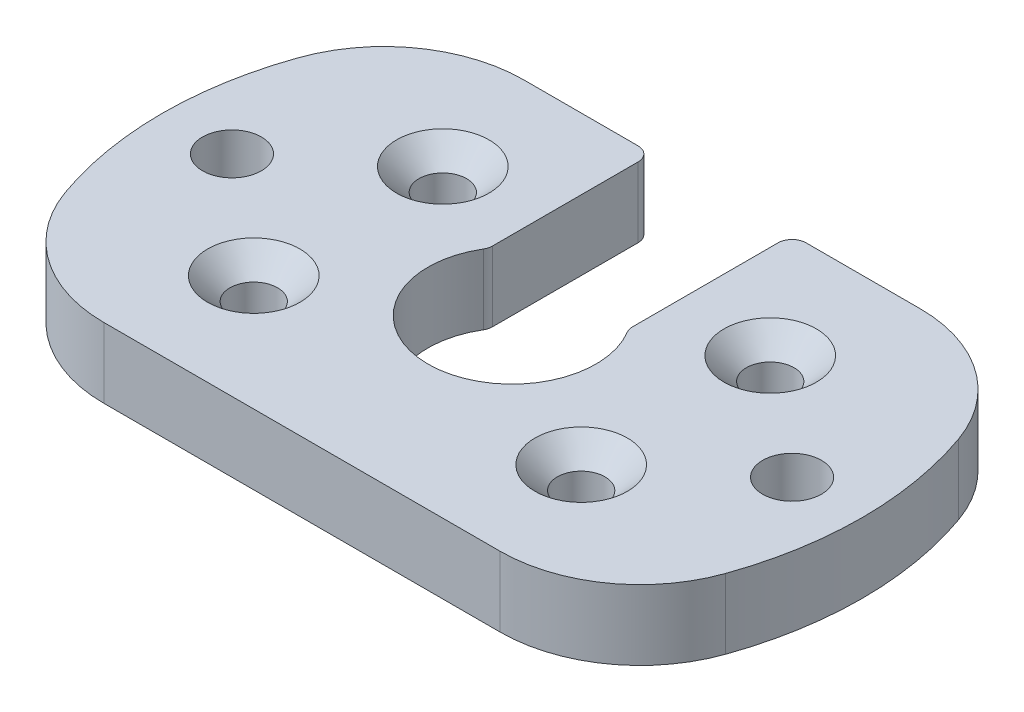
ISO-10303-21;
HEADER;
FILE_DESCRIPTION(('STEP AP214'),'2;1');
FILE_NAME('part.step','',(''),(''),'','','');
FILE_SCHEMA(('AUTOMOTIVE_DESIGN { 1 0 10303 214 1 1 1 1 }'));
ENDSEC;
DATA;
#1=APPLICATION_CONTEXT('core data for automotive mechanical design processes');
#2=APPLICATION_PROTOCOL_DEFINITION('international standard','automotive_design',2000,#1);
#3=PRODUCT_CONTEXT('',#1,'mechanical');
#4=PRODUCT('Part','Part','',(#3));
#5=PRODUCT_RELATED_PRODUCT_CATEGORY('part','',(#4));
#6=PRODUCT_DEFINITION_FORMATION('','',#4);
#7=PRODUCT_DEFINITION_CONTEXT('part definition',#1,'design');
#8=PRODUCT_DEFINITION('design','',#6,#7);
#9=PRODUCT_DEFINITION_SHAPE('','',#8);
#10=(LENGTH_UNIT() NAMED_UNIT(*) SI_UNIT(.MILLI.,.METRE.));
#11=(NAMED_UNIT(*) PLANE_ANGLE_UNIT() SI_UNIT($,.RADIAN.));
#12=(NAMED_UNIT(*) SI_UNIT($,.STERADIAN.) SOLID_ANGLE_UNIT());
#13=UNCERTAINTY_MEASURE_WITH_UNIT(LENGTH_MEASURE(1.E-05),#10,'distance_accuracy_value','');
#14=(GEOMETRIC_REPRESENTATION_CONTEXT(3) GLOBAL_UNCERTAINTY_ASSIGNED_CONTEXT((#13)) GLOBAL_UNIT_ASSIGNED_CONTEXT((#10,
#11,#12)) REPRESENTATION_CONTEXT('',''));
#15=CARTESIAN_POINT('',(0.,0.,0.));
#16=DIRECTION('',(0.,0.,1.));
#17=DIRECTION('',(1.,0.,0.));
#18=AXIS2_PLACEMENT_3D('',#15,#16,#17);
#19=CARTESIAN_POINT('',(-39.1659799904243,0.,-15.));
#20=DIRECTION('',(0.,0.,1.));
#21=DIRECTION('',(1.,0.,0.));
#22=AXIS2_PLACEMENT_3D('',#19,#20,#21);
#23=PLANE('',#22);
#24=DIRECTION('',(1.,0.,0.));
#25=VECTOR('',#24,1.);
#26=CARTESIAN_POINT('',(-39.1659799904243,5.,-15.));
#27=LINE('',#26,#25);
#28=CARTESIAN_POINT('',(-14.142135623731,5.,-15.));
#29=VERTEX_POINT('',#28);
#30=CARTESIAN_POINT('',(-6.,5.,-15.));
#31=VERTEX_POINT('',#30);
#32=EDGE_CURVE('E294',#29,#31,#27,.T.);
#33=ORIENTED_EDGE('',*,*,#32,.T.);
#34=DIRECTION('',(0.,1.,0.));
#35=VECTOR('',#34,1.);
#36=CARTESIAN_POINT('',(-6.,0.,-15.));
#37=LINE('',#36,#35);
#38=CARTESIAN_POINT('',(-6.,0.,-15.));
#39=VERTEX_POINT('',#38);
#40=EDGE_CURVE('E11',#31,#39,#37,.F.);
#41=ORIENTED_EDGE('',*,*,#40,.T.);
#42=DIRECTION('',(1.,0.,0.));
#43=VECTOR('',#42,1.);
#44=CARTESIAN_POINT('',(0.,0.,-15.));
#45=LINE('',#44,#43);
#46=CARTESIAN_POINT('',(-14.142135623731,0.,-15.));
#47=VERTEX_POINT('',#46);
#48=EDGE_CURVE('E180',#47,#39,#45,.T.);
#49=ORIENTED_EDGE('',*,*,#48,.F.);
#50=DIRECTION('',(0.,-1.,0.));
#51=VECTOR('',#50,1.);
#52=CARTESIAN_POINT('',(-14.142135623731,0.,-15.));
#53=LINE('',#52,#51);
#54=EDGE_CURVE('E233',#47,#29,#53,.F.);
#55=ORIENTED_EDGE('',*,*,#54,.T.);
#56=EDGE_LOOP('',(#33,#41,#49,#55));
#57=FACE_BOUND('',#56,.T.);
#58=ADVANCED_FACE('F43',(#57),#23,.F.);
#59=CARTESIAN_POINT('',(0.,5.,0.));
#60=DIRECTION('',(0.,-1.,0.));
#61=DIRECTION('',(0.,0.,-1.));
#62=AXIS2_PLACEMENT_3D('',#59,#60,#61);
#63=CYLINDRICAL_SURFACE('',#62,25.);
#64=CARTESIAN_POINT('',(0.,5.,0.));
#65=DIRECTION('',(0.,1.,0.));
#66=DIRECTION('',(0.,0.,1.));
#67=AXIS2_PLACEMENT_3D('',#64,#65,#66);
#68=CIRCLE('',#67,25.);
#69=CARTESIAN_POINT('',(-23.5702260395516,5.,-8.33333333333334));
#70=VERTEX_POINT('',#69);
#71=CARTESIAN_POINT('',(-23.5702260395516,5.,8.33333333333334));
#72=VERTEX_POINT('',#71);
#73=EDGE_CURVE('E186',#70,#72,#68,.T.);
#74=ORIENTED_EDGE('',*,*,#73,.F.);
#75=DIRECTION('',(0.,-1.,0.));
#76=VECTOR('',#75,1.);
#77=CARTESIAN_POINT('',(-23.5702260395516,5.,-8.33333333333334));
#78=LINE('',#77,#76);
#79=CARTESIAN_POINT('',(-23.5702260395516,0.,-8.33333333333334));
#80=VERTEX_POINT('',#79);
#81=EDGE_CURVE('E248',#70,#80,#78,.T.);
#82=ORIENTED_EDGE('',*,*,#81,.T.);
#83=CARTESIAN_POINT('',(0.,0.,0.));
#84=DIRECTION('',(0.,1.,0.));
#85=DIRECTION('',(0.,0.,1.));
#86=AXIS2_PLACEMENT_3D('',#83,#84,#85);
#87=CIRCLE('',#86,25.);
#88=CARTESIAN_POINT('',(-23.5702260395516,0.,8.33333333333334));
#89=VERTEX_POINT('',#88);
#90=EDGE_CURVE('E187',#80,#89,#87,.T.);
#91=ORIENTED_EDGE('',*,*,#90,.T.);
#92=DIRECTION('',(0.,-1.,0.));
#93=VECTOR('',#92,1.);
#94=CARTESIAN_POINT('',(-23.5702260395516,5.,8.33333333333334));
#95=LINE('',#94,#93);
#96=EDGE_CURVE('E245',#89,#72,#95,.F.);
#97=ORIENTED_EDGE('',*,*,#96,.T.);
#98=EDGE_LOOP('',(#74,#82,#91,#97));
#99=FACE_BOUND('',#98,.T.);
#100=ADVANCED_FACE('F343',(#99),#63,.T.);
#101=CARTESIAN_POINT('',(23.5702260395516,0.,8.33333333333334));
#102=VERTEX_POINT('',#101);
#103=CARTESIAN_POINT('',(23.5702260395516,0.,-8.33333333333334));
#104=VERTEX_POINT('',#103);
#105=EDGE_CURVE('E175',#102,#104,#87,.T.);
#106=ORIENTED_EDGE('',*,*,#105,.T.);
#107=DIRECTION('',(0.,-1.,0.));
#108=VECTOR('',#107,1.);
#109=CARTESIAN_POINT('',(23.5702260395516,5.,-8.33333333333334));
#110=LINE('',#109,#108);
#111=CARTESIAN_POINT('',(23.5702260395516,5.,-8.33333333333334));
#112=VERTEX_POINT('',#111);
#113=EDGE_CURVE('E179',#104,#112,#110,.F.);
#114=ORIENTED_EDGE('',*,*,#113,.T.);
#115=CARTESIAN_POINT('',(23.5702260395516,5.,8.33333333333334));
#116=VERTEX_POINT('',#115);
#117=EDGE_CURVE('E178',#116,#112,#68,.T.);
#118=ORIENTED_EDGE('',*,*,#117,.F.);
#119=DIRECTION('',(0.,-1.,0.));
#120=VECTOR('',#119,1.);
#121=CARTESIAN_POINT('',(23.5702260395516,5.,8.33333333333334));
#122=LINE('',#121,#120);
#123=EDGE_CURVE('E161',#116,#102,#122,.T.);
#124=ORIENTED_EDGE('',*,*,#123,.T.);
#125=EDGE_LOOP('',(#106,#114,#118,#124));
#126=FACE_BOUND('',#125,.T.);
#127=ADVANCED_FACE('F173',(#126),#63,.T.);
#128=CARTESIAN_POINT('',(0.,5.,0.));
#129=DIRECTION('',(0.,1.,0.));
#130=DIRECTION('',(0.,0.,1.));
#131=AXIS2_PLACEMENT_3D('',#128,#129,#130);
#132=PLANE('',#131);
#133=DIRECTION('',(0.,0.,-1.));
#134=VECTOR('',#133,1.);
#135=CARTESIAN_POINT('',(5.,5.,-15.));
#136=LINE('',#135,#134);
#137=CARTESIAN_POINT('',(5.,5.,-3.605551275464));
#138=VERTEX_POINT('',#137);
#139=CARTESIAN_POINT('',(5.,5.,-14.));
#140=VERTEX_POINT('',#139);
#141=EDGE_CURVE('E615',#138,#140,#136,.T.);
#142=ORIENTED_EDGE('',*,*,#141,.F.);
#143=CARTESIAN_POINT('',(6.,5.,-3.605551275464));
#144=DIRECTION('',(0.,1.,0.));
#145=DIRECTION('',(0.,0.,1.));
#146=AXIS2_PLACEMENT_3D('',#143,#144,#145);
#147=CIRCLE('',#146,1.);
#148=CARTESIAN_POINT('',(5.14285714285714,5.,-3.09047252182628));
#149=VERTEX_POINT('',#148);
#150=EDGE_CURVE('E277',#138,#149,#147,.T.);
#151=ORIENTED_EDGE('',*,*,#150,.T.);
#152=CARTESIAN_POINT('',(0.,5.,0.));
#153=DIRECTION('',(0.,1.,0.));
#154=DIRECTION('',(0.,0.,1.));
#155=AXIS2_PLACEMENT_3D('',#152,#153,#154);
#156=CIRCLE('',#155,6.);
#157=CARTESIAN_POINT('',(-5.14285714285714,5.,-3.09047252182628));
#158=VERTEX_POINT('',#157);
#159=EDGE_CURVE('E255',#158,#149,#156,.T.);
#160=ORIENTED_EDGE('',*,*,#159,.F.);
#161=CARTESIAN_POINT('',(-6.,5.,-3.605551275464));
#162=DIRECTION('',(0.,1.,0.));
#163=DIRECTION('',(0.,0.,1.));
#164=AXIS2_PLACEMENT_3D('',#161,#162,#163);
#165=CIRCLE('',#164,1.);
#166=CARTESIAN_POINT('',(-5.,5.,-3.605551275464));
#167=VERTEX_POINT('',#166);
#168=EDGE_CURVE('E275',#158,#167,#165,.T.);
#169=ORIENTED_EDGE('',*,*,#168,.T.);
#170=DIRECTION('',(0.,0.,1.));
#171=VECTOR('',#170,1.);
#172=CARTESIAN_POINT('',(-5.,5.,-15.));
#173=LINE('',#172,#171);
#174=CARTESIAN_POINT('',(-5.,5.,-14.));
#175=VERTEX_POINT('',#174);
#176=EDGE_CURVE('E619',#175,#167,#173,.T.);
#177=ORIENTED_EDGE('',*,*,#176,.F.);
#178=CARTESIAN_POINT('',(-6.,5.,-14.));
#179=DIRECTION('',(0.,1.,0.));
#180=DIRECTION('',(0.,0.,1.));
#181=AXIS2_PLACEMENT_3D('',#178,#179,#180);
#182=CIRCLE('',#181,1.);
#183=EDGE_CURVE('E66',#175,#31,#182,.T.);
#184=ORIENTED_EDGE('',*,*,#183,.T.);
#185=ORIENTED_EDGE('',*,*,#32,.F.);
#186=CARTESIAN_POINT('',(-14.142135623731,5.,-5.));
#187=DIRECTION('',(0.,1.,0.));
#188=DIRECTION('',(0.,0.,1.));
#189=AXIS2_PLACEMENT_3D('',#186,#187,#188);
#190=CIRCLE('',#189,10.);
#191=EDGE_CURVE('E226',#29,#70,#190,.T.);
#192=ORIENTED_EDGE('',*,*,#191,.T.);
#193=ORIENTED_EDGE('',*,*,#73,.T.);
#194=CARTESIAN_POINT('',(-14.142135623731,5.,5.));
#195=DIRECTION('',(0.,1.,0.));
#196=DIRECTION('',(0.,0.,1.));
#197=AXIS2_PLACEMENT_3D('',#194,#195,#196);
#198=CIRCLE('',#197,10.);
#199=CARTESIAN_POINT('',(-14.142135623731,5.,15.));
#200=VERTEX_POINT('',#199);
#201=EDGE_CURVE('E224',#72,#200,#198,.T.);
#202=ORIENTED_EDGE('',*,*,#201,.T.);
#203=DIRECTION('',(-1.,0.,0.));
#204=VECTOR('',#203,1.);
#205=CARTESIAN_POINT('',(-39.1659799904243,5.,15.));
#206=LINE('',#205,#204);
#207=CARTESIAN_POINT('',(14.1421356237309,5.,15.));
#208=VERTEX_POINT('',#207);
#209=EDGE_CURVE('E254',#208,#200,#206,.T.);
#210=ORIENTED_EDGE('',*,*,#209,.F.);
#211=CARTESIAN_POINT('',(14.142135623731,5.,5.));
#212=DIRECTION('',(0.,1.,0.));
#213=DIRECTION('',(0.,0.,1.));
#214=AXIS2_PLACEMENT_3D('',#211,#212,#213);
#215=CIRCLE('',#214,10.);
#216=EDGE_CURVE('E228',#208,#116,#215,.T.);
#217=ORIENTED_EDGE('',*,*,#216,.T.);
#218=ORIENTED_EDGE('',*,*,#117,.T.);
#219=CARTESIAN_POINT('',(14.142135623731,5.,-5.));
#220=DIRECTION('',(0.,1.,0.));
#221=DIRECTION('',(0.,0.,1.));
#222=AXIS2_PLACEMENT_3D('',#219,#220,#221);
#223=CIRCLE('',#222,10.);
#224=CARTESIAN_POINT('',(14.1421356237309,5.,-15.));
#225=VERTEX_POINT('',#224);
#226=EDGE_CURVE('E230',#112,#225,#223,.T.);
#227=ORIENTED_EDGE('',*,*,#226,.T.);
#228=CARTESIAN_POINT('',(6.,5.,-15.));
#229=VERTEX_POINT('',#228);
#230=EDGE_CURVE('E287',#229,#225,#27,.T.);
#231=ORIENTED_EDGE('',*,*,#230,.F.);
#232=CARTESIAN_POINT('',(6.,5.,-14.));
#233=DIRECTION('',(0.,1.,0.));
#234=DIRECTION('',(0.,0.,1.));
#235=AXIS2_PLACEMENT_3D('',#232,#233,#234);
#236=CIRCLE('',#235,1.);
#237=EDGE_CURVE('E58',#229,#140,#236,.T.);
#238=ORIENTED_EDGE('',*,*,#237,.T.);
#239=EDGE_LOOP('',(#142,#151,#160,#169,#177,#184,#185,#192,#193,#202,#210,#217,#218,#227,#231,#238));
#240=FACE_BOUND('',#239,.T.);
#241=CARTESIAN_POINT('',(-20.,5.,0.));
#242=DIRECTION('',(0.,1.,0.));
#243=DIRECTION('',(0.,0.,1.));
#244=AXIS2_PLACEMENT_3D('',#241,#242,#243);
#245=CIRCLE('',#244,2.09999999999999);
#246=CARTESIAN_POINT('',(-20.,5.,2.09999999999999));
#247=VERTEX_POINT('',#246);
#248=EDGE_CURVE('E217',#247,#247,#245,.T.);
#249=ORIENTED_EDGE('',*,*,#248,.F.);
#250=EDGE_LOOP('',(#249));
#251=FACE_BOUND('',#250,.T.);
#252=CARTESIAN_POINT('',(20.,5.,0.));
#253=DIRECTION('',(0.,1.,0.));
#254=DIRECTION('',(0.,0.,1.));
#255=AXIS2_PLACEMENT_3D('',#252,#253,#254);
#256=CIRCLE('',#255,2.09999999999999);
#257=CARTESIAN_POINT('',(20.,5.,2.09999999999999));
#258=VERTEX_POINT('',#257);
#259=EDGE_CURVE('E216',#258,#258,#256,.T.);
#260=ORIENTED_EDGE('',*,*,#259,.F.);
#261=EDGE_LOOP('',(#260));
#262=FACE_BOUND('',#261,.T.);
#263=CARTESIAN_POINT('',(11.6913429510899,5.,-6.75));
#264=DIRECTION('',(0.,1.,0.));
#265=DIRECTION('',(0.,0.,1.));
#266=AXIS2_PLACEMENT_3D('',#263,#264,#265);
#267=CIRCLE('',#266,3.3);
#268=CARTESIAN_POINT('',(11.6913429510899,5.,-3.45));
#269=VERTEX_POINT('',#268);
#270=EDGE_CURVE('E308',#269,#269,#267,.T.);
#271=ORIENTED_EDGE('',*,*,#270,.F.);
#272=EDGE_LOOP('',(#271));
#273=FACE_BOUND('',#272,.T.);
#274=CARTESIAN_POINT('',(11.6913429510899,5.,6.75));
#275=DIRECTION('',(0.,1.,0.));
#276=DIRECTION('',(0.,0.,1.));
#277=AXIS2_PLACEMENT_3D('',#274,#275,#276);
#278=CIRCLE('',#277,3.3);
#279=CARTESIAN_POINT('',(11.6913429510899,5.,10.05));
#280=VERTEX_POINT('',#279);
#281=EDGE_CURVE('E211',#280,#280,#278,.T.);
#282=ORIENTED_EDGE('',*,*,#281,.F.);
#283=EDGE_LOOP('',(#282));
#284=FACE_BOUND('',#283,.T.);
#285=CARTESIAN_POINT('',(-11.6913429510899,5.,6.75000000000001));
#286=DIRECTION('',(0.,1.,0.));
#287=DIRECTION('',(0.,0.,1.));
#288=AXIS2_PLACEMENT_3D('',#285,#286,#287);
#289=CIRCLE('',#288,3.3);
#290=CARTESIAN_POINT('',(-11.6913429510899,5.,10.05));
#291=VERTEX_POINT('',#290);
#292=EDGE_CURVE('E206',#291,#291,#289,.T.);
#293=ORIENTED_EDGE('',*,*,#292,.F.);
#294=EDGE_LOOP('',(#293));
#295=FACE_BOUND('',#294,.T.);
#296=CARTESIAN_POINT('',(-11.6913429510899,5.,-6.74999999999999));
#297=DIRECTION('',(0.,1.,0.));
#298=DIRECTION('',(0.,0.,1.));
#299=AXIS2_PLACEMENT_3D('',#296,#297,#298);
#300=CIRCLE('',#299,3.3);
#301=CARTESIAN_POINT('',(-11.6913429510899,5.,-3.44999999999999));
#302=VERTEX_POINT('',#301);
#303=EDGE_CURVE('E201',#302,#302,#300,.T.);
#304=ORIENTED_EDGE('',*,*,#303,.F.);
#305=EDGE_LOOP('',(#304));
#306=FACE_BOUND('',#305,.T.);
#307=ADVANCED_FACE('F290',(#240,#251,#262,#273,#284,#295,#306),#132,.T.);
#308=CARTESIAN_POINT('',(0.,0.,0.));
#309=DIRECTION('',(0.,1.,0.));
#310=DIRECTION('',(0.,0.,1.));
#311=AXIS2_PLACEMENT_3D('',#308,#309,#310);
#312=PLANE('',#311);
#313=CARTESIAN_POINT('',(0.,0.,0.));
#314=DIRECTION('',(0.,1.,0.));
#315=DIRECTION('',(0.,0.,1.));
#316=AXIS2_PLACEMENT_3D('',#313,#314,#315);
#317=CIRCLE('',#316,6.);
#318=CARTESIAN_POINT('',(-5.14285714285714,0.,-3.09047252182628));
#319=VERTEX_POINT('',#318);
#320=CARTESIAN_POINT('',(5.14285714285714,0.,-3.09047252182628));
#321=VERTEX_POINT('',#320);
#322=EDGE_CURVE('E252',#319,#321,#317,.T.);
#323=ORIENTED_EDGE('',*,*,#322,.T.);
#324=CARTESIAN_POINT('',(6.,0.,-3.605551275464));
#325=DIRECTION('',(0.,1.,0.));
#326=DIRECTION('',(0.,0.,1.));
#327=AXIS2_PLACEMENT_3D('',#324,#325,#326);
#328=CIRCLE('',#327,1.);
#329=CARTESIAN_POINT('',(5.,0.,-3.605551275464));
#330=VERTEX_POINT('',#329);
#331=EDGE_CURVE('E267',#321,#330,#328,.F.);
#332=ORIENTED_EDGE('',*,*,#331,.T.);
#333=DIRECTION('',(0.,0.,-1.));
#334=VECTOR('',#333,1.);
#335=CARTESIAN_POINT('',(5.,0.,0.));
#336=LINE('',#335,#334);
#337=CARTESIAN_POINT('',(5.,0.,-14.));
#338=VERTEX_POINT('',#337);
#339=EDGE_CURVE('E612',#330,#338,#336,.T.);
#340=ORIENTED_EDGE('',*,*,#339,.T.);
#341=CARTESIAN_POINT('',(6.,0.,-14.));
#342=DIRECTION('',(0.,1.,0.));
#343=DIRECTION('',(0.,0.,1.));
#344=AXIS2_PLACEMENT_3D('',#341,#342,#343);
#345=CIRCLE('',#344,1.);
#346=CARTESIAN_POINT('',(6.,0.,-15.));
#347=VERTEX_POINT('',#346);
#348=EDGE_CURVE('E263',#338,#347,#345,.F.);
#349=ORIENTED_EDGE('',*,*,#348,.T.);
#350=CARTESIAN_POINT('',(14.142135623731,0.,-15.));
#351=VERTEX_POINT('',#350);
#352=EDGE_CURVE('E220',#347,#351,#45,.T.);
#353=ORIENTED_EDGE('',*,*,#352,.T.);
#354=CARTESIAN_POINT('',(14.142135623731,0.,-5.));
#355=DIRECTION('',(0.,1.,0.));
#356=DIRECTION('',(0.,0.,1.));
#357=AXIS2_PLACEMENT_3D('',#354,#355,#356);
#358=CIRCLE('',#357,10.);
#359=EDGE_CURVE('E167',#351,#104,#358,.F.);
#360=ORIENTED_EDGE('',*,*,#359,.T.);
#361=ORIENTED_EDGE('',*,*,#105,.F.);
#362=CARTESIAN_POINT('',(14.142135623731,0.,5.));
#363=DIRECTION('',(0.,1.,0.));
#364=DIRECTION('',(0.,0.,1.));
#365=AXIS2_PLACEMENT_3D('',#362,#363,#364);
#366=CIRCLE('',#365,10.);
#367=CARTESIAN_POINT('',(14.142135623731,0.,15.));
#368=VERTEX_POINT('',#367);
#369=EDGE_CURVE('E157',#102,#368,#366,.F.);
#370=ORIENTED_EDGE('',*,*,#369,.T.);
#371=DIRECTION('',(-1.,0.,0.));
#372=VECTOR('',#371,1.);
#373=CARTESIAN_POINT('',(0.,0.,15.));
#374=LINE('',#373,#372);
#375=CARTESIAN_POINT('',(-14.142135623731,0.,15.));
#376=VERTEX_POINT('',#375);
#377=EDGE_CURVE('E218',#368,#376,#374,.T.);
#378=ORIENTED_EDGE('',*,*,#377,.T.);
#379=CARTESIAN_POINT('',(-14.142135623731,0.,5.));
#380=DIRECTION('',(0.,1.,0.));
#381=DIRECTION('',(0.,0.,1.));
#382=AXIS2_PLACEMENT_3D('',#379,#380,#381);
#383=CIRCLE('',#382,10.);
#384=EDGE_CURVE('E238',#376,#89,#383,.F.);
#385=ORIENTED_EDGE('',*,*,#384,.T.);
#386=ORIENTED_EDGE('',*,*,#90,.F.);
#387=CARTESIAN_POINT('',(-14.142135623731,0.,-5.));
#388=DIRECTION('',(0.,1.,0.));
#389=DIRECTION('',(0.,0.,1.));
#390=AXIS2_PLACEMENT_3D('',#387,#388,#389);
#391=CIRCLE('',#390,10.);
#392=EDGE_CURVE('E168',#80,#47,#391,.F.);
#393=ORIENTED_EDGE('',*,*,#392,.T.);
#394=ORIENTED_EDGE('',*,*,#48,.T.);
#395=CARTESIAN_POINT('',(-6.,0.,-14.));
#396=DIRECTION('',(0.,1.,0.));
#397=DIRECTION('',(0.,0.,1.));
#398=AXIS2_PLACEMENT_3D('',#395,#396,#397);
#399=CIRCLE('',#398,1.);
#400=CARTESIAN_POINT('',(-5.,0.,-14.));
#401=VERTEX_POINT('',#400);
#402=EDGE_CURVE('E261',#39,#401,#399,.F.);
#403=ORIENTED_EDGE('',*,*,#402,.T.);
#404=DIRECTION('',(0.,0.,1.));
#405=VECTOR('',#404,1.);
#406=CARTESIAN_POINT('',(-5.,0.,0.));
#407=LINE('',#406,#405);
#408=CARTESIAN_POINT('',(-5.,0.,-3.605551275464));
#409=VERTEX_POINT('',#408);
#410=EDGE_CURVE('E607',#401,#409,#407,.T.);
#411=ORIENTED_EDGE('',*,*,#410,.T.);
#412=CARTESIAN_POINT('',(-6.,0.,-3.605551275464));
#413=DIRECTION('',(0.,1.,0.));
#414=DIRECTION('',(0.,0.,1.));
#415=AXIS2_PLACEMENT_3D('',#412,#413,#414);
#416=CIRCLE('',#415,1.);
#417=EDGE_CURVE('E265',#409,#319,#416,.F.);
#418=ORIENTED_EDGE('',*,*,#417,.T.);
#419=EDGE_LOOP('',(#323,#332,#340,#349,#353,#360,#361,#370,#378,#385,#386,#393,#394,#403,#411,#418));
#420=FACE_BOUND('',#419,.T.);
#421=CARTESIAN_POINT('',(-20.,0.,0.));
#422=DIRECTION('',(0.,1.,0.));
#423=DIRECTION('',(0.,0.,1.));
#424=AXIS2_PLACEMENT_3D('',#421,#422,#423);
#425=CIRCLE('',#424,2.09999999999999);
#426=CARTESIAN_POINT('',(-20.,0.,2.09999999999999));
#427=VERTEX_POINT('',#426);
#428=EDGE_CURVE('E213',#427,#427,#425,.T.);
#429=ORIENTED_EDGE('',*,*,#428,.T.);
#430=EDGE_LOOP('',(#429));
#431=FACE_BOUND('',#430,.T.);
#432=CARTESIAN_POINT('',(20.,0.,0.));
#433=DIRECTION('',(0.,1.,0.));
#434=DIRECTION('',(0.,0.,1.));
#435=AXIS2_PLACEMENT_3D('',#432,#433,#434);
#436=CIRCLE('',#435,2.09999999999999);
#437=CARTESIAN_POINT('',(20.,0.,2.09999999999999));
#438=VERTEX_POINT('',#437);
#439=EDGE_CURVE('E305',#438,#438,#436,.T.);
#440=ORIENTED_EDGE('',*,*,#439,.T.);
#441=EDGE_LOOP('',(#440));
#442=FACE_BOUND('',#441,.T.);
#443=CARTESIAN_POINT('',(11.6913429510899,0.,-6.75));
#444=DIRECTION('',(0.,1.,0.));
#445=DIRECTION('',(0.,0.,1.));
#446=AXIS2_PLACEMENT_3D('',#443,#444,#445);
#447=CIRCLE('',#446,1.69999999999999);
#448=CARTESIAN_POINT('',(11.6913429510899,0.,-5.05000000000001));
#449=VERTEX_POINT('',#448);
#450=EDGE_CURVE('E208',#449,#449,#447,.T.);
#451=ORIENTED_EDGE('',*,*,#450,.T.);
#452=EDGE_LOOP('',(#451));
#453=FACE_BOUND('',#452,.T.);
#454=CARTESIAN_POINT('',(11.6913429510899,0.,6.75));
#455=DIRECTION('',(0.,1.,0.));
#456=DIRECTION('',(0.,0.,1.));
#457=AXIS2_PLACEMENT_3D('',#454,#455,#456);
#458=CIRCLE('',#457,1.69999999999999);
#459=CARTESIAN_POINT('',(11.6913429510899,0.,8.44999999999999));
#460=VERTEX_POINT('',#459);
#461=EDGE_CURVE('E203',#460,#460,#458,.T.);
#462=ORIENTED_EDGE('',*,*,#461,.T.);
#463=EDGE_LOOP('',(#462));
#464=FACE_BOUND('',#463,.T.);
#465=CARTESIAN_POINT('',(-11.6913429510899,0.,6.75000000000001));
#466=DIRECTION('',(0.,1.,0.));
#467=DIRECTION('',(0.,0.,1.));
#468=AXIS2_PLACEMENT_3D('',#465,#466,#467);
#469=CIRCLE('',#468,1.69999999999999);
#470=CARTESIAN_POINT('',(-11.6913429510899,0.,8.45));
#471=VERTEX_POINT('',#470);
#472=EDGE_CURVE('E198',#471,#471,#469,.T.);
#473=ORIENTED_EDGE('',*,*,#472,.T.);
#474=EDGE_LOOP('',(#473));
#475=FACE_BOUND('',#474,.T.);
#476=CARTESIAN_POINT('',(-11.6913429510899,0.,-6.74999999999999));
#477=DIRECTION('',(0.,1.,0.));
#478=DIRECTION('',(0.,0.,1.));
#479=AXIS2_PLACEMENT_3D('',#476,#477,#478);
#480=CIRCLE('',#479,1.69999999999999);
#481=CARTESIAN_POINT('',(-11.6913429510899,0.,-5.05));
#482=VERTEX_POINT('',#481);
#483=EDGE_CURVE('E192',#482,#482,#480,.T.);
#484=ORIENTED_EDGE('',*,*,#483,.T.);
#485=EDGE_LOOP('',(#484));
#486=FACE_BOUND('',#485,.T.);
#487=ADVANCED_FACE('F183',(#420,#431,#442,#453,#464,#475,#486),#312,.F.);
#488=CARTESIAN_POINT('',(-11.6913429510899,5.,-6.74999999999999));
#489=DIRECTION('',(0.,1.,0.));
#490=DIRECTION('',(0.,0.,1.));
#491=AXIS2_PLACEMENT_3D('',#488,#489,#490);
#492=CYLINDRICAL_SURFACE('',#491,1.69999999999999);
#493=CARTESIAN_POINT('',(-11.6913429510899,3.4,-6.74999999999999));
#494=DIRECTION('',(0.,1.,0.));
#495=DIRECTION('',(0.,0.,1.));
#496=AXIS2_PLACEMENT_3D('',#493,#494,#495);
#497=CIRCLE('',#496,1.7);
#498=CARTESIAN_POINT('',(-11.6913429510899,3.4,-5.04999999999999));
#499=VERTEX_POINT('',#498);
#500=EDGE_CURVE('E197',#499,#499,#497,.T.);
#501=ORIENTED_EDGE('',*,*,#500,.T.);
#502=EDGE_LOOP('',(#501));
#503=FACE_BOUND('',#502,.T.);
#504=ORIENTED_EDGE('',*,*,#483,.F.);
#505=EDGE_LOOP('',(#504));
#506=FACE_BOUND('',#505,.T.);
#507=ADVANCED_FACE('F325',(#503,#506),#492,.F.);
#508=CARTESIAN_POINT('',(-11.6913429510899,5.,-6.74999999999999));
#509=DIRECTION('',(0.,1.,0.));
#510=DIRECTION('',(0.,0.,1.));
#511=AXIS2_PLACEMENT_3D('',#508,#509,#510);
#512=CONICAL_SURFACE('',#511,3.3,0.785398163397448);
#513=ORIENTED_EDGE('',*,*,#500,.F.);
#514=EDGE_LOOP('',(#513));
#515=FACE_BOUND('',#514,.T.);
#516=ORIENTED_EDGE('',*,*,#303,.T.);
#517=EDGE_LOOP('',(#516));
#518=FACE_BOUND('',#517,.T.);
#519=ADVANCED_FACE('F328',(#515,#518),#512,.F.);
#520=CARTESIAN_POINT('',(-11.6913429510899,5.,6.75000000000001));
#521=DIRECTION('',(0.,1.,0.));
#522=DIRECTION('',(0.,0.,1.));
#523=AXIS2_PLACEMENT_3D('',#520,#521,#522);
#524=CYLINDRICAL_SURFACE('',#523,1.69999999999999);
#525=CARTESIAN_POINT('',(-11.6913429510899,3.4,6.75000000000001));
#526=DIRECTION('',(0.,1.,0.));
#527=DIRECTION('',(0.,0.,1.));
#528=AXIS2_PLACEMENT_3D('',#525,#526,#527);
#529=CIRCLE('',#528,1.7);
#530=CARTESIAN_POINT('',(-11.6913429510899,3.4,8.45));
#531=VERTEX_POINT('',#530);
#532=EDGE_CURVE('E202',#531,#531,#529,.T.);
#533=ORIENTED_EDGE('',*,*,#532,.T.);
#534=EDGE_LOOP('',(#533));
#535=FACE_BOUND('',#534,.T.);
#536=ORIENTED_EDGE('',*,*,#472,.F.);
#537=EDGE_LOOP('',(#536));
#538=FACE_BOUND('',#537,.T.);
#539=ADVANCED_FACE('F331',(#535,#538),#524,.F.);
#540=CARTESIAN_POINT('',(-11.6913429510899,5.,6.75000000000001));
#541=DIRECTION('',(0.,1.,0.));
#542=DIRECTION('',(0.,0.,1.));
#543=AXIS2_PLACEMENT_3D('',#540,#541,#542);
#544=CONICAL_SURFACE('',#543,3.3,0.785398163397448);
#545=ORIENTED_EDGE('',*,*,#532,.F.);
#546=EDGE_LOOP('',(#545));
#547=FACE_BOUND('',#546,.T.);
#548=ORIENTED_EDGE('',*,*,#292,.T.);
#549=EDGE_LOOP('',(#548));
#550=FACE_BOUND('',#549,.T.);
#551=ADVANCED_FACE('F392',(#547,#550),#544,.F.);
#552=CARTESIAN_POINT('',(11.6913429510899,5.,6.75));
#553=DIRECTION('',(0.,1.,0.));
#554=DIRECTION('',(0.,0.,1.));
#555=AXIS2_PLACEMENT_3D('',#552,#553,#554);
#556=CYLINDRICAL_SURFACE('',#555,1.69999999999999);
#557=CARTESIAN_POINT('',(11.6913429510899,3.4,6.75));
#558=DIRECTION('',(0.,1.,0.));
#559=DIRECTION('',(0.,0.,1.));
#560=AXIS2_PLACEMENT_3D('',#557,#558,#559);
#561=CIRCLE('',#560,1.7);
#562=CARTESIAN_POINT('',(11.6913429510899,3.4,8.45));
#563=VERTEX_POINT('',#562);
#564=EDGE_CURVE('E207',#563,#563,#561,.T.);
#565=ORIENTED_EDGE('',*,*,#564,.T.);
#566=EDGE_LOOP('',(#565));
#567=FACE_BOUND('',#566,.T.);
#568=ORIENTED_EDGE('',*,*,#461,.F.);
#569=EDGE_LOOP('',(#568));
#570=FACE_BOUND('',#569,.T.);
#571=ADVANCED_FACE('F388',(#567,#570),#556,.F.);
#572=CARTESIAN_POINT('',(11.6913429510899,5.,6.75));
#573=DIRECTION('',(0.,1.,0.));
#574=DIRECTION('',(0.,0.,1.));
#575=AXIS2_PLACEMENT_3D('',#572,#573,#574);
#576=CONICAL_SURFACE('',#575,3.3,0.785398163397448);
#577=ORIENTED_EDGE('',*,*,#564,.F.);
#578=EDGE_LOOP('',(#577));
#579=FACE_BOUND('',#578,.T.);
#580=ORIENTED_EDGE('',*,*,#281,.T.);
#581=EDGE_LOOP('',(#580));
#582=FACE_BOUND('',#581,.T.);
#583=ADVANCED_FACE('F384',(#579,#582),#576,.F.);
#584=CARTESIAN_POINT('',(11.6913429510899,5.,-6.75));
#585=DIRECTION('',(0.,1.,0.));
#586=DIRECTION('',(0.,0.,1.));
#587=AXIS2_PLACEMENT_3D('',#584,#585,#586);
#588=CYLINDRICAL_SURFACE('',#587,1.69999999999999);
#589=CARTESIAN_POINT('',(11.6913429510899,3.4,-6.75));
#590=DIRECTION('',(0.,1.,0.));
#591=DIRECTION('',(0.,0.,1.));
#592=AXIS2_PLACEMENT_3D('',#589,#590,#591);
#593=CIRCLE('',#592,1.7);
#594=CARTESIAN_POINT('',(11.6913429510899,3.4,-5.05000000000001));
#595=VERTEX_POINT('',#594);
#596=EDGE_CURVE('E212',#595,#595,#593,.T.);
#597=ORIENTED_EDGE('',*,*,#596,.T.);
#598=EDGE_LOOP('',(#597));
#599=FACE_BOUND('',#598,.T.);
#600=ORIENTED_EDGE('',*,*,#450,.F.);
#601=EDGE_LOOP('',(#600));
#602=FACE_BOUND('',#601,.T.);
#603=ADVANCED_FACE('F380',(#599,#602),#588,.F.);
#604=CARTESIAN_POINT('',(11.6913429510899,5.,-6.75));
#605=DIRECTION('',(0.,1.,0.));
#606=DIRECTION('',(0.,0.,1.));
#607=AXIS2_PLACEMENT_3D('',#604,#605,#606);
#608=CONICAL_SURFACE('',#607,3.3,0.785398163397448);
#609=ORIENTED_EDGE('',*,*,#596,.F.);
#610=EDGE_LOOP('',(#609));
#611=FACE_BOUND('',#610,.T.);
#612=ORIENTED_EDGE('',*,*,#270,.T.);
#613=EDGE_LOOP('',(#612));
#614=FACE_BOUND('',#613,.T.);
#615=ADVANCED_FACE('F376',(#611,#614),#608,.F.);
#616=CARTESIAN_POINT('',(20.,5.,0.));
#617=DIRECTION('',(0.,1.,0.));
#618=DIRECTION('',(0.,0.,1.));
#619=AXIS2_PLACEMENT_3D('',#616,#617,#618);
#620=CYLINDRICAL_SURFACE('',#619,2.09999999999999);
#621=ORIENTED_EDGE('',*,*,#259,.T.);
#622=EDGE_LOOP('',(#621));
#623=FACE_BOUND('',#622,.T.);
#624=ORIENTED_EDGE('',*,*,#439,.F.);
#625=EDGE_LOOP('',(#624));
#626=FACE_BOUND('',#625,.T.);
#627=ADVANCED_FACE('F370',(#623,#626),#620,.F.);
#628=CARTESIAN_POINT('',(-20.,5.,0.));
#629=DIRECTION('',(0.,1.,0.));
#630=DIRECTION('',(0.,0.,1.));
#631=AXIS2_PLACEMENT_3D('',#628,#629,#630);
#632=CYLINDRICAL_SURFACE('',#631,2.09999999999999);
#633=ORIENTED_EDGE('',*,*,#248,.T.);
#634=EDGE_LOOP('',(#633));
#635=FACE_BOUND('',#634,.T.);
#636=ORIENTED_EDGE('',*,*,#428,.F.);
#637=EDGE_LOOP('',(#636));
#638=FACE_BOUND('',#637,.T.);
#639=ADVANCED_FACE('F365',(#635,#638),#632,.F.);
#640=CARTESIAN_POINT('',(-39.1659799904243,0.,15.));
#641=DIRECTION('',(0.,0.,-1.));
#642=DIRECTION('',(-1.,0.,0.));
#643=AXIS2_PLACEMENT_3D('',#640,#641,#642);
#644=PLANE('',#643);
#645=ORIENTED_EDGE('',*,*,#377,.F.);
#646=DIRECTION('',(0.,-1.,0.));
#647=VECTOR('',#646,1.);
#648=CARTESIAN_POINT('',(14.1421356237309,0.,15.));
#649=LINE('',#648,#647);
#650=EDGE_CURVE('E162',#368,#208,#649,.F.);
#651=ORIENTED_EDGE('',*,*,#650,.T.);
#652=ORIENTED_EDGE('',*,*,#209,.T.);
#653=DIRECTION('',(0.,-1.,0.));
#654=VECTOR('',#653,1.);
#655=CARTESIAN_POINT('',(-14.142135623731,0.,15.));
#656=LINE('',#655,#654);
#657=EDGE_CURVE('E242',#200,#376,#656,.T.);
#658=ORIENTED_EDGE('',*,*,#657,.T.);
#659=EDGE_LOOP('',(#645,#651,#652,#658));
#660=FACE_BOUND('',#659,.T.);
#661=ADVANCED_FACE('F357',(#660),#644,.F.);
#662=ORIENTED_EDGE('',*,*,#352,.F.);
#663=DIRECTION('',(0.,1.,0.));
#664=VECTOR('',#663,1.);
#665=CARTESIAN_POINT('',(6.,0.,-15.));
#666=LINE('',#665,#664);
#667=EDGE_CURVE('E51',#347,#229,#666,.T.);
#668=ORIENTED_EDGE('',*,*,#667,.T.);
#669=ORIENTED_EDGE('',*,*,#230,.T.);
#670=DIRECTION('',(0.,-1.,0.));
#671=VECTOR('',#670,1.);
#672=CARTESIAN_POINT('',(14.1421356237309,0.,-15.));
#673=LINE('',#672,#671);
#674=EDGE_CURVE('E235',#225,#351,#673,.T.);
#675=ORIENTED_EDGE('',*,*,#674,.T.);
#676=EDGE_LOOP('',(#662,#668,#669,#675));
#677=FACE_BOUND('',#676,.T.);
#678=ADVANCED_FACE('F286',(#677),#23,.F.);
#679=CARTESIAN_POINT('',(14.142135623731,5.,-5.));
#680=DIRECTION('',(0.,-1.,0.));
#681=DIRECTION('',(0.,0.,-1.));
#682=AXIS2_PLACEMENT_3D('',#679,#680,#681);
#683=CYLINDRICAL_SURFACE('',#682,10.);
#684=ORIENTED_EDGE('',*,*,#359,.F.);
#685=ORIENTED_EDGE('',*,*,#674,.F.);
#686=ORIENTED_EDGE('',*,*,#226,.F.);
#687=ORIENTED_EDGE('',*,*,#113,.F.);
#688=EDGE_LOOP('',(#684,#685,#686,#687));
#689=FACE_BOUND('',#688,.T.);
#690=ADVANCED_FACE('F356',(#689),#683,.T.);
#691=CARTESIAN_POINT('',(14.142135623731,5.,5.));
#692=DIRECTION('',(0.,-1.,0.));
#693=DIRECTION('',(0.,0.,-1.));
#694=AXIS2_PLACEMENT_3D('',#691,#692,#693);
#695=CYLINDRICAL_SURFACE('',#694,10.);
#696=ORIENTED_EDGE('',*,*,#216,.F.);
#697=ORIENTED_EDGE('',*,*,#650,.F.);
#698=ORIENTED_EDGE('',*,*,#369,.F.);
#699=ORIENTED_EDGE('',*,*,#123,.F.);
#700=EDGE_LOOP('',(#696,#697,#698,#699));
#701=FACE_BOUND('',#700,.T.);
#702=ADVANCED_FACE('F160',(#701),#695,.T.);
#703=CARTESIAN_POINT('',(-14.142135623731,5.,-5.));
#704=DIRECTION('',(0.,-1.,0.));
#705=DIRECTION('',(0.,0.,-1.));
#706=AXIS2_PLACEMENT_3D('',#703,#704,#705);
#707=CYLINDRICAL_SURFACE('',#706,10.);
#708=ORIENTED_EDGE('',*,*,#191,.F.);
#709=ORIENTED_EDGE('',*,*,#54,.F.);
#710=ORIENTED_EDGE('',*,*,#392,.F.);
#711=ORIENTED_EDGE('',*,*,#81,.F.);
#712=EDGE_LOOP('',(#708,#709,#710,#711));
#713=FACE_BOUND('',#712,.T.);
#714=ADVANCED_FACE('F483',(#713),#707,.T.);
#715=CARTESIAN_POINT('',(-14.142135623731,5.,5.));
#716=DIRECTION('',(0.,-1.,0.));
#717=DIRECTION('',(0.,0.,-1.));
#718=AXIS2_PLACEMENT_3D('',#715,#716,#717);
#719=CYLINDRICAL_SURFACE('',#718,10.);
#720=ORIENTED_EDGE('',*,*,#384,.F.);
#721=ORIENTED_EDGE('',*,*,#657,.F.);
#722=ORIENTED_EDGE('',*,*,#201,.F.);
#723=ORIENTED_EDGE('',*,*,#96,.F.);
#724=EDGE_LOOP('',(#720,#721,#722,#723));
#725=FACE_BOUND('',#724,.T.);
#726=ADVANCED_FACE('F492',(#725),#719,.T.);
#727=CARTESIAN_POINT('',(0.,-5.,0.));
#728=DIRECTION('',(0.,1.,0.));
#729=DIRECTION('',(0.,0.,1.));
#730=AXIS2_PLACEMENT_3D('',#727,#728,#729);
#731=CYLINDRICAL_SURFACE('',#730,6.);
#732=ORIENTED_EDGE('',*,*,#159,.T.);
#733=DIRECTION('',(0.,1.,0.));
#734=VECTOR('',#733,1.);
#735=CARTESIAN_POINT('',(5.14285714285714,-5.,-3.09047252182628));
#736=LINE('',#735,#734);
#737=EDGE_CURVE('E258',#149,#321,#736,.F.);
#738=ORIENTED_EDGE('',*,*,#737,.T.);
#739=ORIENTED_EDGE('',*,*,#322,.F.);
#740=DIRECTION('',(0.,1.,0.));
#741=VECTOR('',#740,1.);
#742=CARTESIAN_POINT('',(-5.14285714285714,-5.,-3.09047252182628));
#743=LINE('',#742,#741);
#744=EDGE_CURVE('E251',#319,#158,#743,.T.);
#745=ORIENTED_EDGE('',*,*,#744,.T.);
#746=EDGE_LOOP('',(#732,#738,#739,#745));
#747=FACE_BOUND('',#746,.T.);
#748=ADVANCED_FACE('F502',(#747),#731,.F.);
#749=CARTESIAN_POINT('',(-5.,-5.,-15.));
#750=DIRECTION('',(-1.,0.,0.));
#751=DIRECTION('',(0.,0.,1.));
#752=AXIS2_PLACEMENT_3D('',#749,#750,#751);
#753=PLANE('',#752);
#754=ORIENTED_EDGE('',*,*,#176,.T.);
#755=DIRECTION('',(0.,1.,0.));
#756=VECTOR('',#755,1.);
#757=CARTESIAN_POINT('',(-5.,-5.,-3.605551275464));
#758=LINE('',#757,#756);
#759=EDGE_CURVE('E282',#167,#409,#758,.F.);
#760=ORIENTED_EDGE('',*,*,#759,.T.);
#761=ORIENTED_EDGE('',*,*,#410,.F.);
#762=DIRECTION('',(0.,1.,0.));
#763=VECTOR('',#762,1.);
#764=CARTESIAN_POINT('',(-5.,-5.,-14.));
#765=LINE('',#764,#763);
#766=EDGE_CURVE('E279',#401,#175,#765,.T.);
#767=ORIENTED_EDGE('',*,*,#766,.T.);
#768=EDGE_LOOP('',(#754,#760,#761,#767));
#769=FACE_BOUND('',#768,.T.);
#770=ADVANCED_FACE('F519',(#769),#753,.F.);
#771=CARTESIAN_POINT('',(5.,-5.,-15.));
#772=DIRECTION('',(1.,0.,0.));
#773=DIRECTION('',(0.,0.,-1.));
#774=AXIS2_PLACEMENT_3D('',#771,#772,#773);
#775=PLANE('',#774);
#776=ORIENTED_EDGE('',*,*,#339,.F.);
#777=DIRECTION('',(0.,1.,0.));
#778=VECTOR('',#777,1.);
#779=CARTESIAN_POINT('',(5.,-5.,-3.605551275464));
#780=LINE('',#779,#778);
#781=EDGE_CURVE('E271',#330,#138,#780,.T.);
#782=ORIENTED_EDGE('',*,*,#781,.T.);
#783=ORIENTED_EDGE('',*,*,#141,.T.);
#784=DIRECTION('',(0.,1.,0.));
#785=VECTOR('',#784,1.);
#786=CARTESIAN_POINT('',(5.,-5.,-14.));
#787=LINE('',#786,#785);
#788=EDGE_CURVE('E269',#140,#338,#787,.F.);
#789=ORIENTED_EDGE('',*,*,#788,.T.);
#790=EDGE_LOOP('',(#776,#782,#783,#789));
#791=FACE_BOUND('',#790,.T.);
#792=ADVANCED_FACE('F525',(#791),#775,.F.);
#793=CARTESIAN_POINT('',(6.,-5.,-3.605551275464));
#794=DIRECTION('',(0.,1.,0.));
#795=DIRECTION('',(0.,0.,1.));
#796=AXIS2_PLACEMENT_3D('',#793,#794,#795);
#797=CYLINDRICAL_SURFACE('',#796,1.);
#798=ORIENTED_EDGE('',*,*,#150,.F.);
#799=ORIENTED_EDGE('',*,*,#781,.F.);
#800=ORIENTED_EDGE('',*,*,#331,.F.);
#801=ORIENTED_EDGE('',*,*,#737,.F.);
#802=EDGE_LOOP('',(#798,#799,#800,#801));
#803=FACE_BOUND('',#802,.T.);
#804=ADVANCED_FACE('F532',(#803),#797,.T.);
#805=CARTESIAN_POINT('',(-6.,-5.,-3.605551275464));
#806=DIRECTION('',(0.,1.,0.));
#807=DIRECTION('',(0.,0.,1.));
#808=AXIS2_PLACEMENT_3D('',#805,#806,#807);
#809=CYLINDRICAL_SURFACE('',#808,1.);
#810=ORIENTED_EDGE('',*,*,#417,.F.);
#811=ORIENTED_EDGE('',*,*,#759,.F.);
#812=ORIENTED_EDGE('',*,*,#168,.F.);
#813=ORIENTED_EDGE('',*,*,#744,.F.);
#814=EDGE_LOOP('',(#810,#811,#812,#813));
#815=FACE_BOUND('',#814,.T.);
#816=ADVANCED_FACE('F540',(#815),#809,.T.);
#817=CARTESIAN_POINT('',(6.,0.,-14.));
#818=DIRECTION('',(0.,1.,0.));
#819=DIRECTION('',(0.,0.,1.));
#820=AXIS2_PLACEMENT_3D('',#817,#818,#819);
#821=CYLINDRICAL_SURFACE('',#820,1.);
#822=ORIENTED_EDGE('',*,*,#348,.F.);
#823=ORIENTED_EDGE('',*,*,#788,.F.);
#824=ORIENTED_EDGE('',*,*,#237,.F.);
#825=ORIENTED_EDGE('',*,*,#667,.F.);
#826=EDGE_LOOP('',(#822,#823,#824,#825));
#827=FACE_BOUND('',#826,.T.);
#828=ADVANCED_FACE('F548',(#827),#821,.T.);
#829=CARTESIAN_POINT('',(-6.,-5.,-14.));
#830=DIRECTION('',(0.,1.,0.));
#831=DIRECTION('',(0.,0.,1.));
#832=AXIS2_PLACEMENT_3D('',#829,#830,#831);
#833=CYLINDRICAL_SURFACE('',#832,1.);
#834=ORIENTED_EDGE('',*,*,#402,.F.);
#835=ORIENTED_EDGE('',*,*,#40,.F.);
#836=ORIENTED_EDGE('',*,*,#183,.F.);
#837=ORIENTED_EDGE('',*,*,#766,.F.);
#838=EDGE_LOOP('',(#834,#835,#836,#837));
#839=FACE_BOUND('',#838,.T.);
#840=ADVANCED_FACE('F45',(#839),#833,.T.);
#841=CLOSED_SHELL('',(#58,#100,#127,#307,#487,#507,#519,#539,#551,#571,#583,#603,#615,#627,#639,
#661,#678,#690,#702,#714,#726,#748,#770,#792,#804,#816,#828,#840));
#842=MANIFOLD_SOLID_BREP('B2',#841);
#843=ADVANCED_BREP_SHAPE_REPRESENTATION('',(#18,#842),#14);
#844=SHAPE_DEFINITION_REPRESENTATION(#9,#843);
ENDSEC;
END-ISO-10303-21;
